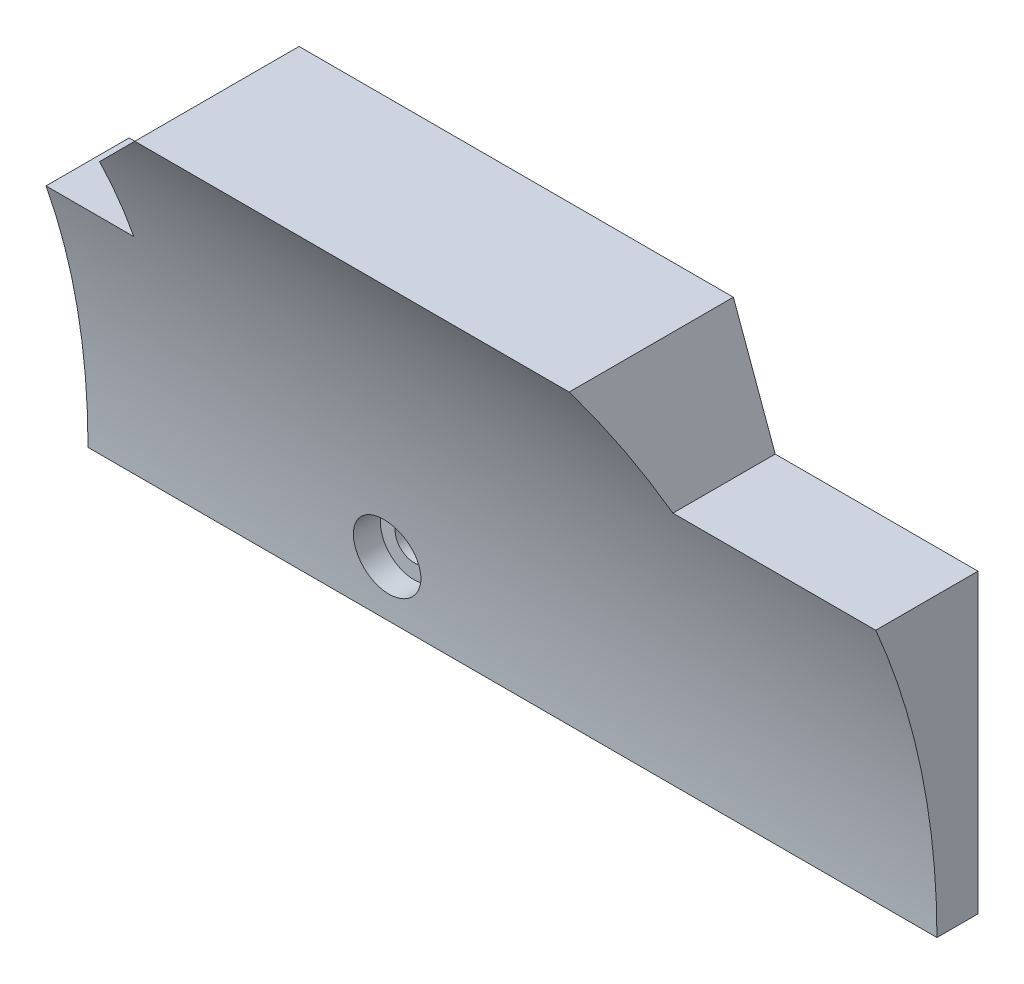
ISO-10303-21;
HEADER;
FILE_DESCRIPTION(('STEP AP214'),'2;1');
FILE_NAME('part.step','',(''),(''),'','','');
FILE_SCHEMA(('AUTOMOTIVE_DESIGN { 1 0 10303 214 1 1 1 1 }'));
ENDSEC;
DATA;
#1=APPLICATION_CONTEXT('core data for automotive mechanical design processes');
#2=APPLICATION_PROTOCOL_DEFINITION('international standard','automotive_design',2000,#1);
#3=PRODUCT_CONTEXT('',#1,'mechanical');
#4=PRODUCT('Part','Part','',(#3));
#5=PRODUCT_RELATED_PRODUCT_CATEGORY('part','',(#4));
#6=PRODUCT_DEFINITION_FORMATION('','',#4);
#7=PRODUCT_DEFINITION_CONTEXT('part definition',#1,'design');
#8=PRODUCT_DEFINITION('design','',#6,#7);
#9=PRODUCT_DEFINITION_SHAPE('','',#8);
#10=(LENGTH_UNIT() NAMED_UNIT(*) SI_UNIT(.MILLI.,.METRE.));
#11=(NAMED_UNIT(*) PLANE_ANGLE_UNIT() SI_UNIT($,.RADIAN.));
#12=(NAMED_UNIT(*) SI_UNIT($,.STERADIAN.) SOLID_ANGLE_UNIT());
#13=UNCERTAINTY_MEASURE_WITH_UNIT(LENGTH_MEASURE(1.E-05),#10,'distance_accuracy_value','');
#14=(GEOMETRIC_REPRESENTATION_CONTEXT(3) GLOBAL_UNCERTAINTY_ASSIGNED_CONTEXT((#13)) GLOBAL_UNIT_ASSIGNED_CONTEXT((#10,
#11,#12)) REPRESENTATION_CONTEXT('',''));
#15=CARTESIAN_POINT('',(0.,0.,0.));
#16=DIRECTION('',(0.,0.,1.));
#17=DIRECTION('',(1.,0.,0.));
#18=AXIS2_PLACEMENT_3D('',#15,#16,#17);
#19=CARTESIAN_POINT('',(19.999999999998,43.4250980548058,0.));
#20=DIRECTION('',(0.,0.,1.));
#21=DIRECTION('',(1.,0.,0.));
#22=AXIS2_PLACEMENT_3D('',#19,#20,#21);
#23=CYLINDRICAL_SURFACE('',#22,1.15000000000313);
#24=CARTESIAN_POINT('',(19.999999999998,43.4250980548058,0.));
#25=DIRECTION('',(0.,0.,1.));
#26=DIRECTION('',(1.,0.,0.));
#27=AXIS2_PLACEMENT_3D('',#24,#25,#26);
#28=CIRCLE('',#27,1.15000000000313);
#29=CARTESIAN_POINT('',(21.1500000000011,43.4250980548058,0.));
#30=VERTEX_POINT('',#29);
#31=EDGE_CURVE('E211',#30,#30,#28,.T.);
#32=ORIENTED_EDGE('',*,*,#31,.F.);
#33=EDGE_LOOP('',(#32));
#34=FACE_BOUND('',#33,.T.);
#35=CARTESIAN_POINT('',(19.999999999998,43.4250980548058,1.));
#36=DIRECTION('',(0.,0.,1.));
#37=DIRECTION('',(1.,0.,0.));
#38=AXIS2_PLACEMENT_3D('',#35,#36,#37);
#39=CIRCLE('',#38,1.15000000000313);
#40=CARTESIAN_POINT('',(21.1500000000011,43.4250980548058,1.));
#41=VERTEX_POINT('',#40);
#42=EDGE_CURVE('E43',#41,#41,#39,.F.);
#43=ORIENTED_EDGE('',*,*,#42,.F.);
#44=EDGE_LOOP('',(#43));
#45=FACE_BOUND('',#44,.T.);
#46=ADVANCED_FACE('F39',(#34,#45),#23,.F.);
#47=CARTESIAN_POINT('',(1.6500000000003,39.9250980548054,48.1667138374092));
#48=DIRECTION('',(1.,0.,0.));
#49=DIRECTION('',(0.,0.,-1.));
#50=AXIS2_PLACEMENT_3D('',#47,#48,#49);
#51=CYLINDRICAL_SURFACE('',#50,45.6667138374092);
#52=CARTESIAN_POINT('',(47.578726295331,39.9250980548054,48.1667138374092));
#53=DIRECTION('',(-0.939692620785907,-0.342020143325673,0.));
#54=DIRECTION('',(0.342020143325673,-0.939692620785907,0.));
#55=AXIS2_PLACEMENT_3D('',#52,#53,#54);
#56=ELLIPSE('',#55,48.5975018077892,45.6667138374092);
#57=CARTESIAN_POINT('',(38.4522083601362,65.0000000000003,10.));
#58=VERTEX_POINT('',#57);
#59=CARTESIAN_POINT('',(40.9999999999997,58.0000000000003,6.22930008334694));
#60=VERTEX_POINT('',#59);
#61=EDGE_CURVE('E57',#58,#60,#56,.T.);
#62=ORIENTED_EDGE('',*,*,#61,.F.);
#63=DIRECTION('',(-1.,0.,0.));
#64=VECTOR('',#63,1.);
#65=CARTESIAN_POINT('',(38.4522083601362,65.0000000000003,10.));
#66=LINE('',#65,#64);
#67=CARTESIAN_POINT('',(11.9999999999992,65.0000000000003,10.));
#68=VERTEX_POINT('',#67);
#69=EDGE_CURVE('E117',#58,#68,#66,.T.);
#70=ORIENTED_EDGE('',*,*,#69,.T.);
#71=CARTESIAN_POINT('',(-13.0749019451952,39.9250980548054,48.1667138374092));
#72=DIRECTION('',(0.707106781186552,-0.707106781186543,0.));
#73=DIRECTION('',(0.707106781186543,0.707106781186552,0.));
#74=AXIS2_PLACEMENT_3D('',#71,#72,#73);
#75=ELLIPSE('',#74,64.5824860578748,45.6667138374092);
#76=CARTESIAN_POINT('',(6.99999999999923,60.0000000000001,7.14907050434291));
#77=VERTEX_POINT('',#76);
#78=EDGE_CURVE('E209',#77,#68,#75,.T.);
#79=ORIENTED_EDGE('',*,*,#78,.F.);
#80=CARTESIAN_POINT('',(6.9999999999993,39.9250980548054,48.1667138374092));
#81=DIRECTION('',(1.,0.,0.));
#82=DIRECTION('',(0.,1.,0.));
#83=AXIS2_PLACEMENT_3D('',#80,#81,#82);
#84=CIRCLE('',#83,45.6667138374092);
#85=CARTESIAN_POINT('',(6.99999999999924,55.0000000000001,5.05991525469622));
#86=VERTEX_POINT('',#85);
#87=EDGE_CURVE('E214',#86,#77,#84,.T.);
#88=ORIENTED_EDGE('',*,*,#87,.F.);
#89=DIRECTION('',(1.,0.,0.));
#90=VECTOR('',#89,1.);
#91=CARTESIAN_POINT('',(1.65000000000011,55.0000000000001,5.05991525469622));
#92=LINE('',#91,#90);
#93=CARTESIAN_POINT('',(1.6500000000003,55.0000000000001,5.05991525469622));
#94=VERTEX_POINT('',#93);
#95=EDGE_CURVE('E250',#94,#86,#92,.T.);
#96=ORIENTED_EDGE('',*,*,#95,.F.);
#97=CARTESIAN_POINT('',(1.6500000000003,39.9250980548054,48.1667138374092));
#98=DIRECTION('',(1.,0.,0.));
#99=DIRECTION('',(0.,0.,1.));
#100=AXIS2_PLACEMENT_3D('',#97,#98,#99);
#101=CIRCLE('',#100,45.6667138374092);
#102=CARTESIAN_POINT('',(1.6500000000003,39.9250980548059,2.5));
#103=VERTEX_POINT('',#102);
#104=EDGE_CURVE('E252',#103,#94,#101,.T.);
#105=ORIENTED_EDGE('',*,*,#104,.F.);
#106=DIRECTION('',(1.,0.,0.));
#107=VECTOR('',#106,1.);
#108=CARTESIAN_POINT('',(1.6500000000003,39.9250980548059,2.5));
#109=LINE('',#108,#107);
#110=CARTESIAN_POINT('',(53.3499999999999,39.9250980548059,2.5));
#111=VERTEX_POINT('',#110);
#112=EDGE_CURVE('E97',#103,#111,#109,.T.);
#113=ORIENTED_EDGE('',*,*,#112,.T.);
#114=CARTESIAN_POINT('',(53.3499999999999,39.9250980548054,48.1667138374092));
#115=DIRECTION('',(1.,0.,0.));
#116=DIRECTION('',(0.,0.,1.));
#117=AXIS2_PLACEMENT_3D('',#114,#115,#116);
#118=CIRCLE('',#117,45.6667138374092);
#119=CARTESIAN_POINT('',(53.3499999999999,58.0000000000002,6.22930008334691));
#120=VERTEX_POINT('',#119);
#121=EDGE_CURVE('E255',#111,#120,#118,.T.);
#122=ORIENTED_EDGE('',*,*,#121,.T.);
#123=DIRECTION('',(1.,0.,0.));
#124=VECTOR('',#123,1.);
#125=CARTESIAN_POINT('',(1.65000000000039,58.0000000000005,6.22930008334702));
#126=LINE('',#125,#124);
#127=EDGE_CURVE('E202',#60,#120,#126,.T.);
#128=ORIENTED_EDGE('',*,*,#127,.F.);
#129=EDGE_LOOP('',(#62,#70,#79,#88,#96,#105,#113,#122,#128));
#130=FACE_BOUND('',#129,.T.);
#131=CARTESIAN_POINT('',(17.9499999999963,43.4250980548061,2.6343214918733));
#132=CARTESIAN_POINT('',(17.9500050023373,43.3100084166059,2.62547535582466));
#133=CARTESIAN_POINT('',(17.9597237788177,43.1948045627664,2.61706281856671));
#134=CARTESIAN_POINT('',(17.9983947787586,42.9675002376139,2.60131508514162));
#135=CARTESIAN_POINT('',(18.027368974417,42.8554034641616,2.59398113142669));
#136=CARTESIAN_POINT('',(18.1037642605047,42.63763754753,2.5805012212643));
#137=CARTESIAN_POINT('',(18.1511789861406,42.5319662011351,2.57435485601223));
#138=CARTESIAN_POINT('',(18.263119527637,42.3300787945935,2.56325941946487));
#139=CARTESIAN_POINT('',(18.3276412196049,42.2338604633062,2.55831006016233));
#140=CARTESIAN_POINT('',(18.4718455436148,42.0537753901684,2.5495502592139));
#141=CARTESIAN_POINT('',(18.5515006309596,41.9698866913654,2.54573778020532));
#142=CARTESIAN_POINT('',(18.7237924855824,41.8166559784288,2.53912723959167));
#143=CARTESIAN_POINT('',(18.8164296630677,41.7473144241279,2.53632921005114));
#144=CARTESIAN_POINT('',(19.0119453773351,41.6252323285552,2.53161727526276));
#145=CARTESIAN_POINT('',(19.114812878109,41.5724741482005,2.52970242958649));
#146=CARTESIAN_POINT('',(19.3279513209648,41.48496351137,2.52662728256245));
#147=CARTESIAN_POINT('',(19.4382222420517,41.4502110038353,2.52546697907501));
#148=CARTESIAN_POINT('',(19.6630259012623,41.3997044780883,2.52380711738491));
#149=CARTESIAN_POINT('',(19.7775582301307,41.3839486403123,2.52330749589949));
#150=CARTESIAN_POINT('',(20.0076436738459,41.3718779478733,2.52292325419183));
#151=CARTESIAN_POINT('',(20.1231967873756,41.3755630681305,2.5230386331762));
#152=CARTESIAN_POINT('',(20.3520515131573,41.4022702073359,2.52389523529696));
#153=CARTESIAN_POINT('',(20.4653529815439,41.4252934578238,2.52463649829249));
#154=CARTESIAN_POINT('',(20.6864803342494,41.49002272825,2.52681020674958));
#155=CARTESIAN_POINT('',(20.7943062164759,41.5317287553274,2.52824265247525));
#156=CARTESIAN_POINT('',(21.0014174249196,41.6326327671409,2.53190679454866));
#157=CARTESIAN_POINT('',(21.1007030456691,41.6918301483314,2.53413846331947));
#158=CARTESIAN_POINT('',(21.2879198350759,41.8260273329879,2.53953208434279));
#159=CARTESIAN_POINT('',(21.3758510362134,41.9010270912484,2.54269403393408));
#160=CARTESIAN_POINT('',(21.5378648792576,42.064683004535,2.55007628101035));
#161=CARTESIAN_POINT('',(21.6119479554051,42.1533387311869,2.55429654529966));
#162=CARTESIAN_POINT('',(21.7441776905135,42.3417733780478,2.56389245639614));
#163=CARTESIAN_POINT('',(21.8023243575221,42.4415522926398,2.56926810261986));
#164=CARTESIAN_POINT('',(21.9010810078951,42.6494426620068,2.58121687847711));
#165=CARTESIAN_POINT('',(21.941681135163,42.7575587598022,2.58779067818787));
#166=CARTESIAN_POINT('',(22.0041773645385,42.9789943637642,2.60209190463339));
#167=CARTESIAN_POINT('',(22.0260732911154,43.0923139187525,2.60981934219375));
#168=CARTESIAN_POINT('',(22.0506032150165,43.3211800957494,2.6263079802929));
#169=CARTESIAN_POINT('',(22.0531976874159,43.4367308020966,2.63507126477244));
#170=CARTESIAN_POINT('',(22.0389824419626,43.6665696116696,2.65338132199114));
#171=CARTESIAN_POINT('',(22.0221723104421,43.7808576879261,2.66292811142905));
#172=CARTESIAN_POINT('',(21.9695584796998,44.0053327817185,2.68250582505099));
#173=CARTESIAN_POINT('',(21.9336923400187,44.1155050353694,2.69253824168283));
#174=CARTESIAN_POINT('',(21.8439487491928,44.3282492944363,2.71264427273186));
#175=CARTESIAN_POINT('',(21.7900709631021,44.4308211584715,2.72271788791173));
#176=CARTESIAN_POINT('',(21.6656828886919,44.6256762386579,2.74245885439935));
#177=CARTESIAN_POINT('',(21.5951384789676,44.7179377680751,2.75212532367861));
#178=CARTESIAN_POINT('',(21.4394503261221,44.8892985632345,2.77053659645865));
#179=CARTESIAN_POINT('',(21.3543066751185,44.9683979120208,2.77928140577431));
#180=CARTESIAN_POINT('',(21.1720080654509,45.1109983918766,2.79535344888935));
#181=CARTESIAN_POINT('',(21.0748793841133,45.1745327667451,2.80268369667963));
#182=CARTESIAN_POINT('',(20.8712116393528,45.2843652879601,2.81552775788553));
#183=CARTESIAN_POINT('',(20.7646729285357,45.3306640798072,2.82104163932613));
#184=CARTESIAN_POINT('',(20.5459041784511,45.4044243247551,2.82989527519737));
#185=CARTESIAN_POINT('',(20.4337129071209,45.4319991889518,2.83324811270189));
#186=CARTESIAN_POINT('',(20.206251530292,45.4679432730839,2.83762876851246));
#187=CARTESIAN_POINT('',(20.0909815336902,45.4763131714062,2.83865666894344));
#188=CARTESIAN_POINT('',(19.8613062804637,45.4736053598758,2.83832516219519));
#189=CARTESIAN_POINT('',(19.7468997396007,45.4626336266091,2.83697876424821));
#190=CARTESIAN_POINT('',(19.5215688033796,45.4217738963324,2.83200610448911));
#191=CARTESIAN_POINT('',(19.410644396446,45.3918859622116,2.82837985025666));
#192=CARTESIAN_POINT('',(19.1954081353071,45.3140734253813,2.81906536595051));
#193=CARTESIAN_POINT('',(19.0910963286677,45.266148692946,2.81337712104642));
#194=CARTESIAN_POINT('',(18.8919978163513,45.1536539457089,2.8002708545562));
#195=CARTESIAN_POINT('',(18.7972110147522,45.0890840985558,2.79285285039219));
#196=CARTESIAN_POINT('',(18.6192994060538,44.9447548880675,2.77665892952218));
#197=CARTESIAN_POINT('',(18.5362392703513,44.8649166047775,2.76787600402988));
#198=CARTESIAN_POINT('',(18.3846542831782,44.6925112074637,2.74944812359641));
#199=CARTESIAN_POINT('',(18.3161334740467,44.5999405652486,2.73980292997724));
#200=CARTESIAN_POINT('',(18.1951429586218,44.4040448818835,2.7200688997874));
#201=CARTESIAN_POINT('',(18.1427820334092,44.3006529733375,2.70997755794849));
#202=CARTESIAN_POINT('',(18.0562411661085,44.0866102824108,2.68988373193522));
#203=CARTESIAN_POINT('',(18.0220402578851,43.9759680372975,2.67988115845828));
#204=CARTESIAN_POINT('',(17.9816457315036,43.791398520619,2.66390390152999));
#205=CARTESIAN_POINT('',(17.9697957829529,43.7186729629425,2.65778142006822));
#206=CARTESIAN_POINT('',(17.9539713078297,43.5723465465405,2.64582060423375));
#207=CARTESIAN_POINT('',(17.9499967989213,43.498745685852,2.63998227049838));
#208=CARTESIAN_POINT('',(17.9499999999963,43.4250980548061,2.6343214918733));
#209=B_SPLINE_CURVE_WITH_KNOTS('',3,(#131,#132,#133,#134,#135,#136,#137,#138,#139,#140,#141,
#142,#143,#144,#145,#146,#147,#148,#149,#150,#151,#152,#153,#154,#155,#156,#157,#158,#159,#160,
#161,#162,#163,#164,#165,#166,#167,#168,#169,#170,#171,#172,#173,#174,#175,#176,#177,#178,#179,
#180,#181,#182,#183,#184,#185,#186,#187,#188,#189,#190,#191,#192,#193,#194,#195,#196,#197,#198,
#199,#200,#201,#202,#203,#204,#205,#206,#207,#208),.UNSPECIFIED.,.T.,.F.,(4,2,2,2,2,2,2,2,2,2,2,
2,2,2,2,2,2,2,2,2,2,2,2,2,2,2,2,2,2,2,2,2,2,2,2,2,2,2,4),(0.,0.346019044668169,
0.692433608286428,1.03872871204062,1.38494041191405,1.7305278971645,2.0761263047326,
2.42135585909985,2.76658443448908,3.11177994011739,3.4569750004245,3.80219204598218,
4.14740922345405,4.49261449046919,4.83781876997521,5.18301222296668,5.52820550164098,
5.87359242819813,6.21898259602738,6.56507984905306,6.91118448032516,7.25843024415765,
7.6056824657604,7.95365186974375,8.30161907820564,8.64883648622958,8.99604088908748,
9.34112304857538,9.68619301836013,10.0293781544108,10.3725621495065,10.7157486129248,
11.0589316199224,11.4039389220374,11.7490420205002,12.0964199302148,12.4433959077125,
12.6648183239918,12.8862412369064),.UNSPECIFIED.);
#210=CARTESIAN_POINT('',(17.9499999999963,43.4250980548061,2.6343214918733));
#211=VERTEX_POINT('',#210);
#212=EDGE_CURVE('E134',#211,#211,#209,.T.);
#213=ORIENTED_EDGE('',*,*,#212,.F.);
#214=EDGE_LOOP('',(#213));
#215=FACE_BOUND('',#214,.T.);
#216=ADVANCED_FACE('F142',(#130,#215),#51,.F.);
#217=CARTESIAN_POINT('',(53.3499999999999,46.9250980548054,10.));
#218=DIRECTION('',(-1.,0.,0.));
#219=DIRECTION('',(0.,0.,1.));
#220=AXIS2_PLACEMENT_3D('',#217,#218,#219);
#221=PLANE('',#220);
#222=DIRECTION('',(0.,0.,-1.));
#223=VECTOR('',#222,1.);
#224=CARTESIAN_POINT('',(53.3499999999999,58.0000000000002,10.));
#225=LINE('',#224,#223);
#226=CARTESIAN_POINT('',(53.3499999999999,58.0000000000002,0.));
#227=VERTEX_POINT('',#226);
#228=EDGE_CURVE('E11',#120,#227,#225,.T.);
#229=ORIENTED_EDGE('',*,*,#228,.F.);
#230=ORIENTED_EDGE('',*,*,#121,.F.);
#231=DIRECTION('',(0.,0.,-1.));
#232=VECTOR('',#231,1.);
#233=CARTESIAN_POINT('',(53.3499999999999,39.9250980548054,10.));
#234=LINE('',#233,#232);
#235=CARTESIAN_POINT('',(53.3499999999999,39.9250980548054,0.));
#236=VERTEX_POINT('',#235);
#237=EDGE_CURVE('E101',#111,#236,#234,.T.);
#238=ORIENTED_EDGE('',*,*,#237,.T.);
#239=DIRECTION('',(0.,1.,0.));
#240=VECTOR('',#239,1.);
#241=CARTESIAN_POINT('',(53.3499999999999,46.9250980548054,0.));
#242=LINE('',#241,#240);
#243=EDGE_CURVE('E116',#236,#227,#242,.T.);
#244=ORIENTED_EDGE('',*,*,#243,.T.);
#245=EDGE_LOOP('',(#229,#230,#238,#244));
#246=FACE_BOUND('',#245,.T.);
#247=ADVANCED_FACE('F41',(#246),#221,.F.);
#248=CARTESIAN_POINT('',(53.3499999999999,58.0000000000002,10.));
#249=DIRECTION('',(0.,-1.,0.));
#250=DIRECTION('',(1.,0.,0.));
#251=AXIS2_PLACEMENT_3D('',#248,#249,#250);
#252=PLANE('',#251);
#253=DIRECTION('',(0.,0.,-1.));
#254=VECTOR('',#253,1.);
#255=CARTESIAN_POINT('',(40.9999999999997,58.0000000000003,10.));
#256=LINE('',#255,#254);
#257=CARTESIAN_POINT('',(40.9999999999997,58.0000000000003,0.));
#258=VERTEX_POINT('',#257);
#259=EDGE_CURVE('E49',#60,#258,#256,.T.);
#260=ORIENTED_EDGE('',*,*,#259,.F.);
#261=ORIENTED_EDGE('',*,*,#127,.T.);
#262=ORIENTED_EDGE('',*,*,#228,.T.);
#263=DIRECTION('',(-1.,0.,0.));
#264=VECTOR('',#263,1.);
#265=CARTESIAN_POINT('',(53.3499999999999,58.0000000000002,0.));
#266=LINE('',#265,#264);
#267=EDGE_CURVE('E204',#227,#258,#266,.T.);
#268=ORIENTED_EDGE('',*,*,#267,.T.);
#269=EDGE_LOOP('',(#260,#261,#262,#268));
#270=FACE_BOUND('',#269,.T.);
#271=ADVANCED_FACE('F190',(#270),#252,.F.);
#272=CARTESIAN_POINT('',(40.9999999999997,58.0000000000003,10.));
#273=DIRECTION('',(-0.939692620785907,-0.342020143325673,0.));
#274=DIRECTION('',(0.342020143325673,-0.939692620785907,0.));
#275=AXIS2_PLACEMENT_3D('',#272,#273,#274);
#276=PLANE('',#275);
#277=DIRECTION('',(0.,0.,-1.));
#278=VECTOR('',#277,1.);
#279=CARTESIAN_POINT('',(38.4522083601362,65.0000000000003,10.));
#280=LINE('',#279,#278);
#281=CARTESIAN_POINT('',(38.4522083601362,65.0000000000003,0.));
#282=VERTEX_POINT('',#281);
#283=EDGE_CURVE('E131',#58,#282,#280,.T.);
#284=ORIENTED_EDGE('',*,*,#283,.F.);
#285=ORIENTED_EDGE('',*,*,#61,.T.);
#286=ORIENTED_EDGE('',*,*,#259,.T.);
#287=DIRECTION('',(-0.342020143325673,0.939692620785907,0.));
#288=VECTOR('',#287,1.);
#289=CARTESIAN_POINT('',(40.9999999999997,58.0000000000003,0.));
#290=LINE('',#289,#288);
#291=EDGE_CURVE('E207',#258,#282,#290,.T.);
#292=ORIENTED_EDGE('',*,*,#291,.T.);
#293=EDGE_LOOP('',(#284,#285,#286,#292));
#294=FACE_BOUND('',#293,.T.);
#295=ADVANCED_FACE('F187',(#294),#276,.F.);
#296=CARTESIAN_POINT('',(38.4522083601362,65.0000000000003,10.));
#297=DIRECTION('',(0.,-1.,0.));
#298=DIRECTION('',(1.,0.,0.));
#299=AXIS2_PLACEMENT_3D('',#296,#297,#298);
#300=PLANE('',#299);
#301=DIRECTION('',(-1.,0.,0.));
#302=VECTOR('',#301,1.);
#303=CARTESIAN_POINT('',(38.4522083601362,65.0000000000003,0.));
#304=LINE('',#303,#302);
#305=CARTESIAN_POINT('',(11.9999999999992,65.0000000000002,0.));
#306=VERTEX_POINT('',#305);
#307=EDGE_CURVE('E223',#282,#306,#304,.T.);
#308=ORIENTED_EDGE('',*,*,#307,.T.);
#309=DIRECTION('',(0.,0.,-1.));
#310=VECTOR('',#309,1.);
#311=CARTESIAN_POINT('',(11.9999999999992,65.0000000000002,10.));
#312=LINE('',#311,#310);
#313=EDGE_CURVE('E128',#68,#306,#312,.T.);
#314=ORIENTED_EDGE('',*,*,#313,.F.);
#315=ORIENTED_EDGE('',*,*,#69,.F.);
#316=ORIENTED_EDGE('',*,*,#283,.T.);
#317=EDGE_LOOP('',(#308,#314,#315,#316));
#318=FACE_BOUND('',#317,.T.);
#319=ADVANCED_FACE('F183',(#318),#300,.F.);
#320=CARTESIAN_POINT('',(11.9999999999992,65.0000000000002,10.));
#321=DIRECTION('',(0.707106781186552,-0.707106781186543,0.));
#322=DIRECTION('',(0.707106781186543,0.707106781186552,0.));
#323=AXIS2_PLACEMENT_3D('',#320,#321,#322);
#324=PLANE('',#323);
#325=DIRECTION('',(0.,0.,-1.));
#326=VECTOR('',#325,1.);
#327=CARTESIAN_POINT('',(6.99999999999923,60.0000000000001,10.));
#328=LINE('',#327,#326);
#329=CARTESIAN_POINT('',(6.99999999999923,60.0000000000001,0.));
#330=VERTEX_POINT('',#329);
#331=EDGE_CURVE('E126',#77,#330,#328,.T.);
#332=ORIENTED_EDGE('',*,*,#331,.F.);
#333=ORIENTED_EDGE('',*,*,#78,.T.);
#334=ORIENTED_EDGE('',*,*,#313,.T.);
#335=DIRECTION('',(-0.707106781186543,-0.707106781186552,0.));
#336=VECTOR('',#335,1.);
#337=CARTESIAN_POINT('',(11.9999999999992,65.0000000000002,0.));
#338=LINE('',#337,#336);
#339=EDGE_CURVE('E225',#306,#330,#338,.T.);
#340=ORIENTED_EDGE('',*,*,#339,.T.);
#341=EDGE_LOOP('',(#332,#333,#334,#340));
#342=FACE_BOUND('',#341,.T.);
#343=ADVANCED_FACE('F179',(#342),#324,.F.);
#344=CARTESIAN_POINT('',(6.99999999999923,60.0000000000001,10.));
#345=DIRECTION('',(1.,0.,0.));
#346=DIRECTION('',(0.,1.,0.));
#347=AXIS2_PLACEMENT_3D('',#344,#345,#346);
#348=PLANE('',#347);
#349=DIRECTION('',(0.,0.,-1.));
#350=VECTOR('',#349,1.);
#351=CARTESIAN_POINT('',(6.99999999999924,55.0000000000001,10.));
#352=LINE('',#351,#350);
#353=CARTESIAN_POINT('',(6.99999999999924,55.0000000000001,0.));
#354=VERTEX_POINT('',#353);
#355=EDGE_CURVE('E124',#86,#354,#352,.T.);
#356=ORIENTED_EDGE('',*,*,#355,.F.);
#357=ORIENTED_EDGE('',*,*,#87,.T.);
#358=ORIENTED_EDGE('',*,*,#331,.T.);
#359=DIRECTION('',(0.,-1.,0.));
#360=VECTOR('',#359,1.);
#361=CARTESIAN_POINT('',(6.99999999999923,60.0000000000001,0.));
#362=LINE('',#361,#360);
#363=EDGE_CURVE('E228',#330,#354,#362,.T.);
#364=ORIENTED_EDGE('',*,*,#363,.T.);
#365=EDGE_LOOP('',(#356,#357,#358,#364));
#366=FACE_BOUND('',#365,.T.);
#367=ADVANCED_FACE('F175',(#366),#348,.F.);
#368=CARTESIAN_POINT('',(6.99999999999924,55.0000000000001,10.));
#369=DIRECTION('',(0.,-1.,0.));
#370=DIRECTION('',(1.,0.,0.));
#371=AXIS2_PLACEMENT_3D('',#368,#369,#370);
#372=PLANE('',#371);
#373=DIRECTION('',(0.,0.,-1.));
#374=VECTOR('',#373,1.);
#375=CARTESIAN_POINT('',(1.6500000000003,55.0000000000001,10.));
#376=LINE('',#375,#374);
#377=CARTESIAN_POINT('',(1.6500000000003,55.0000000000001,0.));
#378=VERTEX_POINT('',#377);
#379=EDGE_CURVE('E100',#94,#378,#376,.T.);
#380=ORIENTED_EDGE('',*,*,#379,.F.);
#381=ORIENTED_EDGE('',*,*,#95,.T.);
#382=ORIENTED_EDGE('',*,*,#355,.T.);
#383=DIRECTION('',(-1.,0.,0.));
#384=VECTOR('',#383,1.);
#385=CARTESIAN_POINT('',(6.99999999999924,55.0000000000001,0.));
#386=LINE('',#385,#384);
#387=EDGE_CURVE('E110',#354,#378,#386,.T.);
#388=ORIENTED_EDGE('',*,*,#387,.T.);
#389=EDGE_LOOP('',(#380,#381,#382,#388));
#390=FACE_BOUND('',#389,.T.);
#391=ADVANCED_FACE('F172',(#390),#372,.F.);
#392=CARTESIAN_POINT('',(1.6500000000003,39.9250980548054,10.));
#393=DIRECTION('',(1.,0.,0.));
#394=DIRECTION('',(0.,1.,0.));
#395=AXIS2_PLACEMENT_3D('',#392,#393,#394);
#396=PLANE('',#395);
#397=DIRECTION('',(0.,0.,-1.));
#398=VECTOR('',#397,1.);
#399=CARTESIAN_POINT('',(1.6500000000003,39.9250980548054,10.));
#400=LINE('',#399,#398);
#401=CARTESIAN_POINT('',(1.6500000000003,39.9250980548054,0.));
#402=VERTEX_POINT('',#401);
#403=EDGE_CURVE('E89',#103,#402,#400,.T.);
#404=ORIENTED_EDGE('',*,*,#403,.F.);
#405=ORIENTED_EDGE('',*,*,#104,.T.);
#406=ORIENTED_EDGE('',*,*,#379,.T.);
#407=DIRECTION('',(0.,-1.,0.));
#408=VECTOR('',#407,1.);
#409=CARTESIAN_POINT('',(1.6500000000003,39.9250980548054,0.));
#410=LINE('',#409,#408);
#411=EDGE_CURVE('E104',#378,#402,#410,.T.);
#412=ORIENTED_EDGE('',*,*,#411,.T.);
#413=EDGE_LOOP('',(#404,#405,#406,#412));
#414=FACE_BOUND('',#413,.T.);
#415=ADVANCED_FACE('F105',(#414),#396,.F.);
#416=CARTESIAN_POINT('',(53.3499999999999,39.9250980548054,10.));
#417=DIRECTION('',(0.,1.,0.));
#418=DIRECTION('',(0.,0.,1.));
#419=AXIS2_PLACEMENT_3D('',#416,#417,#418);
#420=PLANE('',#419);
#421=ORIENTED_EDGE('',*,*,#237,.F.);
#422=ORIENTED_EDGE('',*,*,#112,.F.);
#423=ORIENTED_EDGE('',*,*,#403,.T.);
#424=DIRECTION('',(1.,0.,0.));
#425=VECTOR('',#424,1.);
#426=CARTESIAN_POINT('',(53.3499999999999,39.9250980548054,0.));
#427=LINE('',#426,#425);
#428=EDGE_CURVE('E94',#402,#236,#427,.T.);
#429=ORIENTED_EDGE('',*,*,#428,.T.);
#430=EDGE_LOOP('',(#421,#422,#423,#429));
#431=FACE_BOUND('',#430,.T.);
#432=ADVANCED_FACE('F92',(#431),#420,.F.);
#433=CARTESIAN_POINT('',(0.,0.,0.));
#434=DIRECTION('',(0.,0.,1.));
#435=DIRECTION('',(1.,0.,0.));
#436=AXIS2_PLACEMENT_3D('',#433,#434,#435);
#437=PLANE('',#436);
#438=ORIENTED_EDGE('',*,*,#31,.T.);
#439=EDGE_LOOP('',(#438));
#440=FACE_BOUND('',#439,.T.);
#441=ORIENTED_EDGE('',*,*,#243,.F.);
#442=ORIENTED_EDGE('',*,*,#428,.F.);
#443=ORIENTED_EDGE('',*,*,#411,.F.);
#444=ORIENTED_EDGE('',*,*,#387,.F.);
#445=ORIENTED_EDGE('',*,*,#363,.F.);
#446=ORIENTED_EDGE('',*,*,#339,.F.);
#447=ORIENTED_EDGE('',*,*,#307,.F.);
#448=ORIENTED_EDGE('',*,*,#291,.F.);
#449=ORIENTED_EDGE('',*,*,#267,.F.);
#450=EDGE_LOOP('',(#441,#442,#443,#444,#445,#446,#447,#448,#449));
#451=FACE_BOUND('',#450,.T.);
#452=ADVANCED_FACE('F113',(#440,#451),#437,.F.);
#453=CARTESIAN_POINT('',(19.9999999999989,43.4250980548061,1.));
#454=DIRECTION('',(0.,0.,1.));
#455=DIRECTION('',(1.,0.,0.));
#456=AXIS2_PLACEMENT_3D('',#453,#454,#455);
#457=PLANE('',#456);
#458=CARTESIAN_POINT('',(19.9999999999989,43.4250980548061,1.));
#459=DIRECTION('',(0.,0.,1.));
#460=DIRECTION('',(1.,0.,0.));
#461=AXIS2_PLACEMENT_3D('',#458,#459,#460);
#462=CIRCLE('',#461,2.05000000000254);
#463=CARTESIAN_POINT('',(22.0500000000014,43.4250980548061,1.));
#464=VERTEX_POINT('',#463);
#465=EDGE_CURVE('E141',#464,#464,#462,.T.);
#466=ORIENTED_EDGE('',*,*,#465,.T.);
#467=EDGE_LOOP('',(#466));
#468=FACE_BOUND('',#467,.T.);
#469=ORIENTED_EDGE('',*,*,#42,.T.);
#470=EDGE_LOOP('',(#469));
#471=FACE_BOUND('',#470,.T.);
#472=ADVANCED_FACE('F149',(#468,#471),#457,.T.);
#473=CARTESIAN_POINT('',(19.9999999999989,43.4250980548061,10.));
#474=DIRECTION('',(0.,0.,-1.));
#475=DIRECTION('',(-1.,0.,0.));
#476=AXIS2_PLACEMENT_3D('',#473,#474,#475);
#477=CYLINDRICAL_SURFACE('',#476,2.05000000000254);
#478=ORIENTED_EDGE('',*,*,#465,.F.);
#479=EDGE_LOOP('',(#478));
#480=FACE_BOUND('',#479,.T.);
#481=ORIENTED_EDGE('',*,*,#212,.T.);
#482=EDGE_LOOP('',(#481));
#483=FACE_BOUND('',#482,.T.);
#484=ADVANCED_FACE('F145',(#480,#483),#477,.F.);
#485=CLOSED_SHELL('',(#46,#216,#247,#271,#295,#319,#343,#367,#391,#415,#432,#452,#472,#484));
#486=MANIFOLD_SOLID_BREP('B2',#485);
#487=ADVANCED_BREP_SHAPE_REPRESENTATION('',(#18,#486),#14);
#488=SHAPE_DEFINITION_REPRESENTATION(#9,#487);
ENDSEC;
END-ISO-10303-21;
